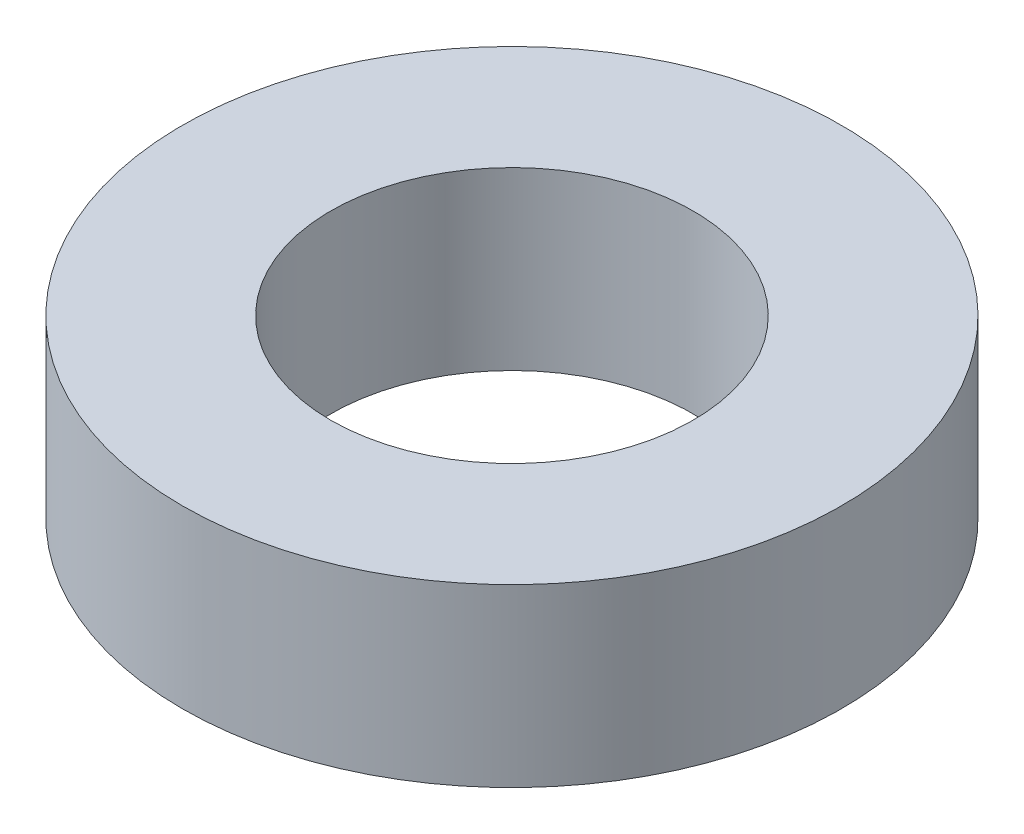
ISO-10303-21;
HEADER;
FILE_DESCRIPTION(('STEP AP214'),'2;1');
FILE_NAME('part.step','',(''),(''),'','','');
FILE_SCHEMA(('AUTOMOTIVE_DESIGN { 1 0 10303 214 1 1 1 1 }'));
ENDSEC;
DATA;
#1=APPLICATION_CONTEXT('core data for automotive mechanical design processes');
#2=APPLICATION_PROTOCOL_DEFINITION('international standard','automotive_design',2000,#1);
#3=PRODUCT_CONTEXT('',#1,'mechanical');
#4=PRODUCT('Part','Part','',(#3));
#5=PRODUCT_RELATED_PRODUCT_CATEGORY('part','',(#4));
#6=PRODUCT_DEFINITION_FORMATION('','',#4);
#7=PRODUCT_DEFINITION_CONTEXT('part definition',#1,'design');
#8=PRODUCT_DEFINITION('design','',#6,#7);
#9=PRODUCT_DEFINITION_SHAPE('','',#8);
#10=(LENGTH_UNIT() NAMED_UNIT(*) SI_UNIT(.MILLI.,.METRE.));
#11=(NAMED_UNIT(*) PLANE_ANGLE_UNIT() SI_UNIT($,.RADIAN.));
#12=(NAMED_UNIT(*) SI_UNIT($,.STERADIAN.) SOLID_ANGLE_UNIT());
#13=UNCERTAINTY_MEASURE_WITH_UNIT(LENGTH_MEASURE(1.E-05),#10,'distance_accuracy_value','');
#14=(GEOMETRIC_REPRESENTATION_CONTEXT(3) GLOBAL_UNCERTAINTY_ASSIGNED_CONTEXT((#13)) GLOBAL_UNIT_ASSIGNED_CONTEXT((#10,
#11,#12)) REPRESENTATION_CONTEXT('',''));
#15=CARTESIAN_POINT('',(0.,0.,0.));
#16=DIRECTION('',(0.,0.,1.));
#17=DIRECTION('',(1.,0.,0.));
#18=AXIS2_PLACEMENT_3D('',#15,#16,#17);
#19=CARTESIAN_POINT('',(0.,1.6,0.));
#20=DIRECTION('',(0.,1.,0.));
#21=DIRECTION('',(0.,0.,1.));
#22=AXIS2_PLACEMENT_3D('',#19,#20,#21);
#23=PLANE('',#22);
#24=CARTESIAN_POINT('',(0.,1.6,0.));
#25=DIRECTION('',(0.,1.,0.));
#26=DIRECTION('',(0.,0.,1.));
#27=AXIS2_PLACEMENT_3D('',#24,#25,#26);
#28=CIRCLE('',#27,3.);
#29=CARTESIAN_POINT('',(0.,1.6,3.));
#30=VERTEX_POINT('',#29);
#31=EDGE_CURVE('E10',#30,#30,#28,.T.);
#32=ORIENTED_EDGE('',*,*,#31,.T.);
#33=EDGE_LOOP('',(#32));
#34=FACE_BOUND('',#33,.T.);
#35=CARTESIAN_POINT('',(0.,1.6,0.));
#36=DIRECTION('',(0.,1.,0.));
#37=DIRECTION('',(0.,0.,1.));
#38=AXIS2_PLACEMENT_3D('',#35,#36,#37);
#39=CIRCLE('',#38,1.65);
#40=CARTESIAN_POINT('',(0.,1.6,1.65));
#41=VERTEX_POINT('',#40);
#42=EDGE_CURVE('E56',#41,#41,#39,.T.);
#43=ORIENTED_EDGE('',*,*,#42,.F.);
#44=EDGE_LOOP('',(#43));
#45=FACE_BOUND('',#44,.T.);
#46=ADVANCED_FACE('F43',(#34,#45),#23,.T.);
#47=CARTESIAN_POINT('',(0.,0.,0.));
#48=DIRECTION('',(0.,1.,0.));
#49=DIRECTION('',(0.,0.,1.));
#50=AXIS2_PLACEMENT_3D('',#47,#48,#49);
#51=PLANE('',#50);
#52=CARTESIAN_POINT('',(0.,0.,0.));
#53=DIRECTION('',(0.,1.,0.));
#54=DIRECTION('',(0.,0.,1.));
#55=AXIS2_PLACEMENT_3D('',#52,#53,#54);
#56=CIRCLE('',#55,3.);
#57=CARTESIAN_POINT('',(0.,0.,3.));
#58=VERTEX_POINT('',#57);
#59=EDGE_CURVE('E47',#58,#58,#56,.T.);
#60=ORIENTED_EDGE('',*,*,#59,.F.);
#61=EDGE_LOOP('',(#60));
#62=FACE_BOUND('',#61,.T.);
#63=CARTESIAN_POINT('',(0.,0.,0.));
#64=DIRECTION('',(0.,1.,0.));
#65=DIRECTION('',(0.,0.,1.));
#66=AXIS2_PLACEMENT_3D('',#63,#64,#65);
#67=CIRCLE('',#66,1.65);
#68=CARTESIAN_POINT('',(0.,0.,1.65));
#69=VERTEX_POINT('',#68);
#70=EDGE_CURVE('E58',#69,#69,#67,.T.);
#71=ORIENTED_EDGE('',*,*,#70,.T.);
#72=EDGE_LOOP('',(#71));
#73=FACE_BOUND('',#72,.T.);
#74=ADVANCED_FACE('F70',(#62,#73),#51,.F.);
#75=CARTESIAN_POINT('',(0.,1.6,0.));
#76=DIRECTION('',(0.,-1.,0.));
#77=DIRECTION('',(0.,0.,-1.));
#78=AXIS2_PLACEMENT_3D('',#75,#76,#77);
#79=CYLINDRICAL_SURFACE('',#78,3.);
#80=ORIENTED_EDGE('',*,*,#31,.F.);
#81=EDGE_LOOP('',(#80));
#82=FACE_BOUND('',#81,.T.);
#83=ORIENTED_EDGE('',*,*,#59,.T.);
#84=EDGE_LOOP('',(#83));
#85=FACE_BOUND('',#84,.T.);
#86=ADVANCED_FACE('F45',(#82,#85),#79,.T.);
#87=CARTESIAN_POINT('',(0.,1.6,0.));
#88=DIRECTION('',(0.,-1.,0.));
#89=DIRECTION('',(0.,0.,-1.));
#90=AXIS2_PLACEMENT_3D('',#87,#88,#89);
#91=CYLINDRICAL_SURFACE('',#90,1.65);
#92=ORIENTED_EDGE('',*,*,#42,.T.);
#93=EDGE_LOOP('',(#92));
#94=FACE_BOUND('',#93,.T.);
#95=ORIENTED_EDGE('',*,*,#70,.F.);
#96=EDGE_LOOP('',(#95));
#97=FACE_BOUND('',#96,.T.);
#98=ADVANCED_FACE('F66',(#94,#97),#91,.F.);
#99=CLOSED_SHELL('',(#46,#74,#86,#98));
#100=MANIFOLD_SOLID_BREP('B2',#99);
#101=ADVANCED_BREP_SHAPE_REPRESENTATION('',(#18,#100),#14);
#102=SHAPE_DEFINITION_REPRESENTATION(#9,#101);
ENDSEC;
END-ISO-10303-21;
